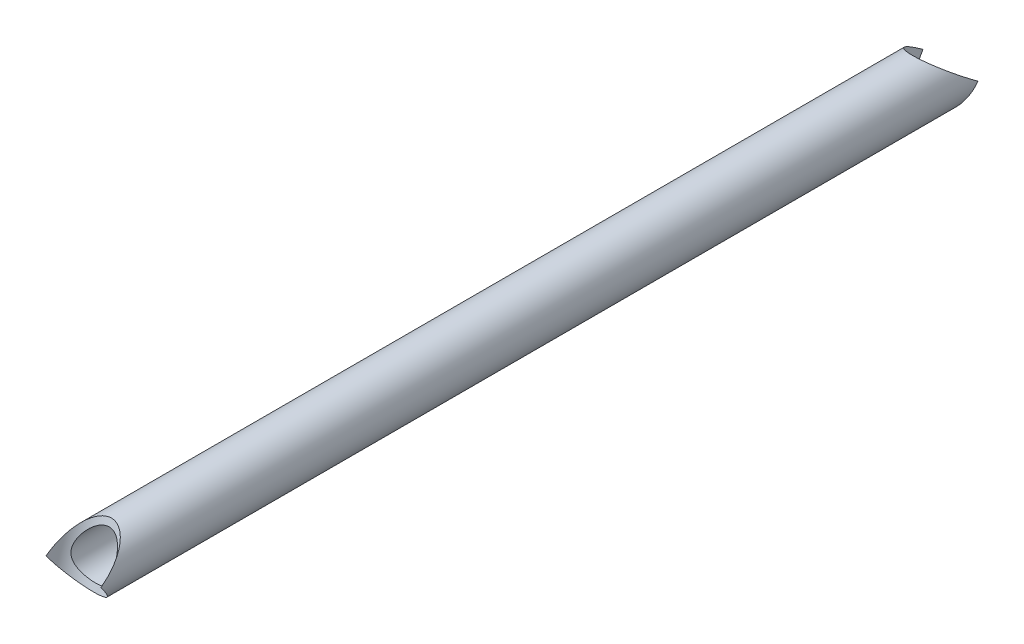
ISO-10303-21;
HEADER;
FILE_DESCRIPTION(('STEP AP214'),'2;1');
FILE_NAME('part.step','',(''),(''),'','','');
FILE_SCHEMA(('AUTOMOTIVE_DESIGN { 1 0 10303 214 1 1 1 1 }'));
ENDSEC;
DATA;
#1=APPLICATION_CONTEXT('core data for automotive mechanical design processes');
#2=APPLICATION_PROTOCOL_DEFINITION('international standard','automotive_design',2000,#1);
#3=PRODUCT_CONTEXT('',#1,'mechanical');
#4=PRODUCT('Part','Part','',(#3));
#5=PRODUCT_RELATED_PRODUCT_CATEGORY('part','',(#4));
#6=PRODUCT_DEFINITION_FORMATION('','',#4);
#7=PRODUCT_DEFINITION_CONTEXT('part definition',#1,'design');
#8=PRODUCT_DEFINITION('design','',#6,#7);
#9=PRODUCT_DEFINITION_SHAPE('','',#8);
#10=(LENGTH_UNIT() NAMED_UNIT(*) SI_UNIT(.MILLI.,.METRE.));
#11=(NAMED_UNIT(*) PLANE_ANGLE_UNIT() SI_UNIT($,.RADIAN.));
#12=(NAMED_UNIT(*) SI_UNIT($,.STERADIAN.) SOLID_ANGLE_UNIT());
#13=UNCERTAINTY_MEASURE_WITH_UNIT(LENGTH_MEASURE(1.E-05),#10,'distance_accuracy_value','');
#14=(GEOMETRIC_REPRESENTATION_CONTEXT(3) GLOBAL_UNCERTAINTY_ASSIGNED_CONTEXT((#13)) GLOBAL_UNIT_ASSIGNED_CONTEXT((#10,
#11,#12)) REPRESENTATION_CONTEXT('',''));
#15=CARTESIAN_POINT('',(0.,0.,0.));
#16=DIRECTION('',(0.,0.,1.));
#17=DIRECTION('',(1.,0.,0.));
#18=AXIS2_PLACEMENT_3D('',#15,#16,#17);
#19=CARTESIAN_POINT('',(1799.99999999996,750.,-202.656542434233));
#20=DIRECTION('',(0.,0.,1.));
#21=DIRECTION('',(0.,-1.,0.));
#22=AXIS2_PLACEMENT_3D('',#19,#20,#21);
#23=CYLINDRICAL_SURFACE('',#22,12.7000000000001);
#24=CARTESIAN_POINT('',(1799.99999999996,750.,202.656542434233));
#25=DIRECTION('',(0.,0.809899948955348,0.586568046080014));
#26=DIRECTION('',(0.,-0.586568046080014,0.809899948955347));
#27=AXIS2_PLACEMENT_3D('',#24,#25,#26);
#28=ELLIPSE('',#27,21.6513669383683,12.7000000000001);
#29=CARTESIAN_POINT('',(1812.69999999996,750.,202.656542434233));
#30=VERTEX_POINT('',#29);
#31=CARTESIAN_POINT('',(1787.29999999996,750.,202.656542434233));
#32=VERTEX_POINT('',#31);
#33=EDGE_CURVE('E73',#30,#32,#28,.T.);
#34=ORIENTED_EDGE('',*,*,#33,.F.);
#35=CARTESIAN_POINT('',(1799.99999999996,750.,202.656542434233));
#36=DIRECTION('',(0.,-0.586568046080014,0.809899948955347));
#37=DIRECTION('',(0.,0.809899948955348,0.586568046080014));
#38=AXIS2_PLACEMENT_3D('',#35,#36,#37);
#39=ELLIPSE('',#38,15.6809492535235,12.7000000000001);
#40=EDGE_CURVE('E80',#32,#30,#39,.T.);
#41=ORIENTED_EDGE('',*,*,#40,.F.);
#42=EDGE_LOOP('',(#34,#41));
#43=FACE_BOUND('',#42,.T.);
#44=CARTESIAN_POINT('',(1799.99999999996,750.,-202.656542434233));
#45=DIRECTION('',(0.,-0.809899948955348,0.586568046080014));
#46=DIRECTION('',(0.,0.586568046080014,0.809899948955348));
#47=AXIS2_PLACEMENT_3D('',#44,#45,#46);
#48=ELLIPSE('',#47,21.6513669383683,12.7000000000001);
#49=CARTESIAN_POINT('',(1787.29999999996,750.,-202.656542434233));
#50=VERTEX_POINT('',#49);
#51=CARTESIAN_POINT('',(1812.69999999996,750.,-202.656542434233));
#52=VERTEX_POINT('',#51);
#53=EDGE_CURVE('E56',#50,#52,#48,.F.);
#54=ORIENTED_EDGE('',*,*,#53,.F.);
#55=CARTESIAN_POINT('',(1799.99999999996,750.,-202.656542434233));
#56=DIRECTION('',(0.,0.586568046080014,0.809899948955348));
#57=DIRECTION('',(0.,-0.809899948955348,0.586568046080014));
#58=AXIS2_PLACEMENT_3D('',#55,#56,#57);
#59=ELLIPSE('',#58,15.6809492535235,12.7000000000001);
#60=EDGE_CURVE('E92',#52,#50,#59,.F.);
#61=ORIENTED_EDGE('',*,*,#60,.F.);
#62=EDGE_LOOP('',(#54,#61));
#63=FACE_BOUND('',#62,.T.);
#64=ADVANCED_FACE('F42',(#43,#63),#23,.T.);
#65=CARTESIAN_POINT('',(1799.99999999996,313.578191864488,345.911093985641));
#66=DIRECTION('',(0.,0.950122861158082,-0.31187585463575));
#67=DIRECTION('',(0.,0.31187585463575,0.950122861158083));
#68=AXIS2_PLACEMENT_3D('',#65,#66,#67);
#69=CYLINDRICAL_SURFACE('',#68,12.7000000000001);
#70=CARTESIAN_POINT('',(1799.99999999996,740.35,192.457442508405));
#71=CARTESIAN_POINT('',(1800.25549487288,740.350001323021,192.457443622493));
#72=CARTESIAN_POINT('',(1800.51102005776,740.360158682982,192.462237696364));
#73=CARTESIAN_POINT('',(1801.02020769019,740.400679650956,192.481299084192));
#74=CARTESIAN_POINT('',(1801.27386920683,740.431052743669,192.495570844827));
#75=CARTESIAN_POINT('',(1801.77777285061,740.511731274688,192.533262770259));
#76=CARTESIAN_POINT('',(1802.02800812342,740.562071931625,192.556699098409));
#77=CARTESIAN_POINT('',(1802.52277876452,740.682119935979,192.612127119238));
#78=CARTESIAN_POINT('',(1802.7673147654,740.751825122821,192.644117857454));
#79=CARTESIAN_POINT('',(1803.24818803531,740.909589137486,192.715725480426));
#80=CARTESIAN_POINT('',(1803.4845527567,740.997577725796,192.75531313677));
#81=CARTESIAN_POINT('',(1803.94864011668,741.191256009569,192.841225094051));
#82=CARTESIAN_POINT('',(1804.17636252112,741.296946184235,192.887549577358));
#83=CARTESIAN_POINT('',(1804.62191045395,741.525149617215,192.98579696155));
#84=CARTESIAN_POINT('',(1804.83973703841,741.647661074751,193.037719263042));
#85=CARTESIAN_POINT('',(1805.2644830828,741.908655160884,193.145880137793));
#86=CARTESIAN_POINT('',(1805.47140170318,742.047139016225,193.202119042475));
#87=CARTESIAN_POINT('',(1805.88486235884,742.347558462195,193.320745857496));
#88=CARTESIAN_POINT('',(1806.09071254282,742.510380261104,193.383301561329));
#89=CARTESIAN_POINT('',(1806.48827673088,742.852030154122,193.509683779826));
#90=CARTESIAN_POINT('',(1806.67998943992,743.03085971127,193.573510410232));
#91=CARTESIAN_POINT('',(1807.04847644642,743.403771719313,193.700246977002));
#92=CARTESIAN_POINT('',(1807.2252438939,743.59786108654,193.763156482198));
#93=CARTESIAN_POINT('',(1807.56285695886,744.000442530672,193.885464860626));
#94=CARTESIAN_POINT('',(1807.72370494432,744.208932457671,193.944864255448));
#95=CARTESIAN_POINT('',(1808.00586503641,744.607500702444,194.048805741095));
#96=CARTESIAN_POINT('',(1808.12949898293,744.79570400977,194.094243514559));
#97=CARTESIAN_POINT('',(1808.36389151701,745.181418667805,194.17827695509));
#98=CARTESIAN_POINT('',(1808.47465239622,745.378928352975,194.216873840611));
#99=CARTESIAN_POINT('',(1808.68241076884,745.782226491587,194.284801348342));
#100=CARTESIAN_POINT('',(1808.77942949396,745.988001529347,194.314146352706));
#101=CARTESIAN_POINT('',(1808.95908020595,746.407047869773,194.361086526165));
#102=CARTESIAN_POINT('',(1809.04171556416,746.620317401672,194.378684451422));
#103=CARTESIAN_POINT('',(1809.17802209854,747.013135936708,194.397666541575));
#104=CARTESIAN_POINT('',(1809.23422572469,747.191692734796,194.401433075631));
#105=CARTESIAN_POINT('',(1809.33612103124,747.551671328574,194.398195401329));
#106=CARTESIAN_POINT('',(1809.38181509837,747.733092463744,194.391193641261));
#107=CARTESIAN_POINT('',(1809.46240314622,748.097322571006,194.365483846722));
#108=CARTESIAN_POINT('',(1809.49730769211,748.280130004714,194.34678731846));
#109=CARTESIAN_POINT('',(1809.55630991435,748.645840700654,194.297187596506));
#110=CARTESIAN_POINT('',(1809.58040744014,748.828743964184,194.266284232755));
#111=CARTESIAN_POINT('',(1809.6179444127,749.193053281423,194.192307085178));
#112=CARTESIAN_POINT('',(1809.63139029556,749.374460173605,194.149240672035));
#113=CARTESIAN_POINT('',(1809.64803300465,749.734564400215,194.05145907232));
#114=CARTESIAN_POINT('',(1809.65122982617,749.913261733396,193.996743880391));
#115=CARTESIAN_POINT('',(1809.64792758712,750.267080111384,193.876542333696));
#116=CARTESIAN_POINT('',(1809.64141882916,750.442197401888,193.811045264331));
#117=CARTESIAN_POINT('',(1809.61933491058,750.787991764668,193.670504152221));
#118=CARTESIAN_POINT('',(1809.60375698339,750.95866746542,193.595457201717));
#119=CARTESIAN_POINT('',(1809.55438111377,751.37859789749,193.397842930488));
#120=CARTESIAN_POINT('',(1809.51537872376,751.624847416442,193.270165722024));
#121=CARTESIAN_POINT('',(1809.42057265609,752.106070085262,193.000597826516));
#122=CARTESIAN_POINT('',(1809.36476006855,752.341037178363,192.858699628624));
#123=CARTESIAN_POINT('',(1809.23770761416,752.800771524353,192.563956842099));
#124=CARTESIAN_POINT('',(1809.16641633948,753.025501694764,192.411076941304));
#125=CARTESIAN_POINT('',(1809.00965259433,753.464530517462,192.09793927942));
#126=CARTESIAN_POINT('',(1808.92418087742,753.678829723269,191.937681910697));
#127=CARTESIAN_POINT('',(1808.69565857415,754.197928400123,191.534527439305));
#128=CARTESIAN_POINT('',(1808.54461852046,754.497002626095,191.288757395988));
#129=CARTESIAN_POINT('',(1808.21405160023,755.07571776881,190.79330278772));
#130=CARTESIAN_POINT('',(1808.03450921087,755.355347976,190.543616156899));
#131=CARTESIAN_POINT('',(1807.64702945255,755.895400680145,190.046285396392));
#132=CARTESIAN_POINT('',(1807.43912541094,756.15584517683,189.798639225894));
#133=CARTESIAN_POINT('',(1806.99390572254,756.657336019245,189.310443348592));
#134=CARTESIAN_POINT('',(1806.75660765288,756.898393817006,189.069889506233));
#135=CARTESIAN_POINT('',(1806.33495427416,757.283069761803,188.679017031083));
#136=CARTESIAN_POINT('',(1806.15910851009,757.432509014754,188.525209054726));
#137=CARTESIAN_POINT('',(1805.79311483468,757.721182189649,188.225024587417));
#138=CARTESIAN_POINT('',(1805.60296445181,757.860414339776,188.078649388044));
#139=CARTESIAN_POINT('',(1805.20840938185,758.127212001948,187.795747066043));
#140=CARTESIAN_POINT('',(1805.00403281708,758.254799440094,187.659201541821));
#141=CARTESIAN_POINT('',(1804.58045996108,758.497140691738,187.398004368798));
#142=CARTESIAN_POINT('',(1804.36126260159,758.611893578547,187.273353578923));
#143=CARTESIAN_POINT('',(1803.96165535103,758.801392178497,187.066328805229));
#144=CARTESIAN_POINT('',(1803.78426766834,758.879195375366,186.980911776346));
#145=CARTESIAN_POINT('',(1803.42129680177,759.025268891258,186.819948007434));
#146=CARTESIAN_POINT('',(1803.23571576256,759.093541685686,186.744398704712));
#147=CARTESIAN_POINT('',(1802.85690652499,759.219567107317,186.604522513021));
#148=CARTESIAN_POINT('',(1802.66367930949,759.277321081338,186.540194187375));
#149=CARTESIAN_POINT('',(1802.2705280698,759.381285446411,186.424126762712));
#150=CARTESIAN_POINT('',(1802.07060725257,759.427501278216,186.372381730407));
#151=CARTESIAN_POINT('',(1801.66326033196,759.507868711331,186.282251378498));
#152=CARTESIAN_POINT('',(1801.45578029441,759.541899143086,186.244000293015));
#153=CARTESIAN_POINT('',(1801.03682497571,759.596463351321,186.182608722936));
#154=CARTESIAN_POINT('',(1800.82534971824,759.616997207794,186.159468148781));
#155=CARTESIAN_POINT('',(1800.40049764253,759.644033353097,186.128990471407));
#156=CARTESIAN_POINT('',(1800.18712210694,759.650544478395,186.121643415859));
#157=CARTESIAN_POINT('',(1799.76047164025,759.64938437089,186.122952075674));
#158=CARTESIAN_POINT('',(1799.54719670084,759.641714652837,186.131606081859));
#159=CARTESIAN_POINT('',(1799.15254040148,759.614458148224,186.162328524437));
#160=CARTESIAN_POINT('',(1798.97086756373,759.596686753307,186.182353065573));
#161=CARTESIAN_POINT('',(1798.61031585242,759.551141487398,186.233604984466));
#162=CARTESIAN_POINT('',(1798.43143800559,759.523364026837,186.264836382548));
#163=CARTESIAN_POINT('',(1798.07762271828,759.458294040171,186.337865874386));
#164=CARTESIAN_POINT('',(1797.90268541324,759.421001187512,186.379664330789));
#165=CARTESIAN_POINT('',(1797.55760743819,759.337491796046,186.473049506639));
#166=CARTESIAN_POINT('',(1797.38746783468,759.291273290782,186.524638383023));
#167=CARTESIAN_POINT('',(1796.99946091007,759.174546553594,186.654568373228));
#168=CARTESIAN_POINT('',(1796.78360370861,759.100986500458,186.736201591388));
#169=CARTESIAN_POINT('',(1796.36247723364,758.941014319533,186.912914513668));
#170=CARTESIAN_POINT('',(1796.15721091011,758.854598636695,187.007997936901));
#171=CARTESIAN_POINT('',(1795.55755505863,758.577939411907,187.310740153673));
#172=CARTESIAN_POINT('',(1795.17967382371,758.370397563077,187.535762858711));
#173=CARTESIAN_POINT('',(1794.57022330676,757.983177373973,187.949079935163));
#174=CARTESIAN_POINT('',(1794.32752412505,757.812251719059,188.129730155375));
#175=CARTESIAN_POINT('',(1793.86438838897,757.454020578336,188.503271716658));
#176=CARTESIAN_POINT('',(1793.64396214969,757.266707577428,188.696168662731));
#177=CARTESIAN_POINT('',(1793.22430267246,756.877108448541,189.090809819131));
#178=CARTESIAN_POINT('',(1793.02511402581,756.674792271883,189.29257143563));
#179=CARTESIAN_POINT('',(1792.64761055721,756.256533226051,189.701282076314));
#180=CARTESIAN_POINT('',(1792.46929255225,756.040592442542,189.908230303619));
#181=CARTESIAN_POINT('',(1792.12586067422,755.586136827798,190.332926803768));
#182=CARTESIAN_POINT('',(1791.9616082846,755.347056026864,190.550765395093));
#183=CARTESIAN_POINT('',(1791.65471745772,754.854180066541,190.985197268986));
#184=CARTESIAN_POINT('',(1791.51208465764,754.600381093244,191.201790212644));
#185=CARTESIAN_POINT('',(1791.24902881245,754.077797945792,191.629194043515));
#186=CARTESIAN_POINT('',(1791.12856353348,753.809043564991,191.840015260545));
#187=CARTESIAN_POINT('',(1790.91061743301,753.254877419365,192.251317490749));
#188=CARTESIAN_POINT('',(1790.81312276071,752.969475822676,192.451804677857));
#189=CARTESIAN_POINT('',(1790.6771616148,752.498200186587,192.75937148386));
#190=CARTESIAN_POINT('',(1790.63067064921,752.318095291124,192.871779890098));
#191=CARTESIAN_POINT('',(1790.54741881902,751.951059653571,193.088954481222));
#192=CARTESIAN_POINT('',(1790.51065952968,751.764127811982,193.193719426891));
#193=CARTESIAN_POINT('',(1790.44777271521,751.383680554363,193.393573852416));
#194=CARTESIAN_POINT('',(1790.4216323178,751.190173419305,193.488674941304));
#195=CARTESIAN_POINT('',(1790.38091806364,750.79676597927,193.667270563039));
#196=CARTESIAN_POINT('',(1790.36633805969,750.596869130917,193.750771244859));
#197=CARTESIAN_POINT('',(1790.34964488383,750.18842971268,193.905333319202));
#198=CARTESIAN_POINT('',(1790.34771583569,749.979803744319,193.976196452484));
#199=CARTESIAN_POINT('',(1790.35781555688,749.558156032711,194.102184646032));
#200=CARTESIAN_POINT('',(1790.36984327894,749.345134620461,194.157310886757));
#201=CARTESIAN_POINT('',(1790.40856621859,748.916918714584,194.250691423387));
#202=CARTESIAN_POINT('',(1790.43524860618,748.701726283196,194.288960424876));
#203=CARTESIAN_POINT('',(1790.50358832469,748.271383818422,194.348553961859));
#204=CARTESIAN_POINT('',(1790.54524469887,748.056233783204,194.369879579651));
#205=CARTESIAN_POINT('',(1790.63588394245,747.661104269435,194.394437457272));
#206=CARTESIAN_POINT('',(1790.68277416739,747.480774887015,194.399936803821));
#207=CARTESIAN_POINT('',(1790.78694036957,747.123067159137,194.400409801545));
#208=CARTESIAN_POINT('',(1790.84422022304,746.945689942152,194.395379516839));
#209=CARTESIAN_POINT('',(1790.96882938514,746.594833647064,194.376025860103));
#210=CARTESIAN_POINT('',(1791.03616917142,746.421358852778,194.361692746282));
#211=CARTESIAN_POINT('',(1791.18042332613,746.079280000255,194.325102471177));
#212=CARTESIAN_POINT('',(1791.25733997726,745.910677115112,194.302843418336));
#213=CARTESIAN_POINT('',(1791.45349474402,745.511420290724,194.241391936386));
#214=CARTESIAN_POINT('',(1791.57721416672,745.283449226378,194.198994951274));
#215=CARTESIAN_POINT('',(1791.84161472563,744.839569213609,194.104885896625));
#216=CARTESIAN_POINT('',(1791.9823018102,744.623664534355,194.053170557186));
#217=CARTESIAN_POINT('',(1792.27977036748,744.204602032014,193.943577939414));
#218=CARTESIAN_POINT('',(1792.43656711958,744.001456610333,193.885694809198));
#219=CARTESIAN_POINT('',(1792.76525293462,743.608875504925,193.766578538638));
#220=CARTESIAN_POINT('',(1792.93714056116,743.419438519505,193.705345717336));
#221=CARTESIAN_POINT('',(1793.29826092813,743.051856941739,193.580852366665));
#222=CARTESIAN_POINT('',(1793.48773855288,742.873958594179,193.51757506114));
#223=CARTESIAN_POINT('',(1793.88064626233,742.53384150912,193.392173068986));
#224=CARTESIAN_POINT('',(1794.08407664852,742.371623110617,193.3300484073));
#225=CARTESIAN_POINT('',(1794.50399080142,742.063744048421,193.208846212577));
#226=CARTESIAN_POINT('',(1794.72047529117,741.918084303191,193.149768848664));
#227=CARTESIAN_POINT('',(1795.1654456827,741.644294048444,193.036342385922));
#228=CARTESIAN_POINT('',(1795.39393154046,741.516163474658,192.981993269757));
#229=CARTESIAN_POINT('',(1795.87570590617,741.27131159708,192.876436030639));
#230=CARTESIAN_POINT('',(1796.12966047647,741.15573141817,192.825610328285));
#231=CARTESIAN_POINT('',(1796.64804191089,740.94654757622,192.732459102261));
#232=CARTESIAN_POINT('',(1796.91247065245,740.852947874092,192.69013511081));
#233=CARTESIAN_POINT('',(1797.44914912554,740.689027614362,192.61535969527));
#234=CARTESIAN_POINT('',(1797.72137977262,740.618654775917,192.582886112645));
#235=CARTESIAN_POINT('',(1798.2718415182,740.501839816053,192.528686956707));
#236=CARTESIAN_POINT('',(1798.55006873468,740.455382669913,192.506954635679));
#237=CARTESIAN_POINT('',(1799.0239031941,740.397505462288,192.479810169177));
#238=CARTESIAN_POINT('',(1799.21858824696,740.379702873918,192.471433839901));
#239=CARTESIAN_POINT('',(1799.60884294999,740.355949683136,192.460249605056));
#240=CARTESIAN_POINT('',(1799.80441259316,740.349998987196,192.457441655544));
#241=CARTESIAN_POINT('',(1799.99999999996,740.35,192.457442508405));
#242=B_SPLINE_CURVE_WITH_KNOTS('',3,(#70,#71,#72,#73,#74,#75,#76,#77,#78,#79,#80,#81,#82,#83,
#84,#85,#86,#87,#88,#89,#90,#91,#92,#93,#94,#95,#96,#97,#98,#99,#100,#101,#102,#103,#104,#105,
#106,#107,#108,#109,#110,#111,#112,#113,#114,#115,#116,#117,#118,#119,#120,#121,#122,#123,#124,
#125,#126,#127,#128,#129,#130,#131,#132,#133,#134,#135,#136,#137,#138,#139,#140,#141,#142,#143,
#144,#145,#146,#147,#148,#149,#150,#151,#152,#153,#154,#155,#156,#157,#158,#159,#160,#161,#162,
#163,#164,#165,#166,#167,#168,#169,#170,#171,#172,#173,#174,#175,#176,#177,#178,#179,#180,#181,
#182,#183,#184,#185,#186,#187,#188,#189,#190,#191,#192,#193,#194,#195,#196,#197,#198,#199,#200,
#201,#202,#203,#204,#205,#206,#207,#208,#209,#210,#211,#212,#213,#214,#215,#216,#217,#218,#219,
#220,#221,#222,#223,#224,#225,#226,#227,#228,#229,#230,#231,#232,#233,#234,#235,#236,#237,#238,
#239,#240,#241),.UNSPECIFIED.,.T.,.F.,(4,2,2,2,2,2,2,2,2,2,2,2,2,2,2,2,2,2,2,2,2,2,2,2,2,2,2,2,
2,2,2,2,2,2,2,2,2,2,2,2,2,2,2,2,2,2,2,2,2,2,2,2,2,2,2,2,2,2,2,2,2,2,2,2,2,2,2,2,2,2,2,2,2,2,2,2,
2,2,2,2,2,2,2,2,2,4),(0.,0.766291926195464,1.53294363049779,2.30095360517248,3.0688779244002,
3.83390490849069,4.59895260612126,5.36391846636314,6.12894311822342,6.93751371653178,
7.74615829026181,8.55517150941467,9.36406420838398,10.0526235118687,10.7410600502143,
11.4284210685424,12.1156207579064,12.6767400225528,13.2377317293871,13.7981723558383,
14.3586207902745,14.9187303247367,15.4788401167754,16.0395099214707,16.6003508498326,
17.4393160703436,18.2787267509923,19.1209691319105,19.9631667703063,21.2080852878345,
22.4536841488168,23.6978317349493,24.9412389010381,25.7726609367374,26.6042269561632,
27.4341934239309,28.2642197788698,28.898775998303,29.5331670916535,30.1674769010515,
30.8014870375264,31.4416371939636,32.0817835562693,32.7215264101874,33.3612009328634,
33.9114722405448,34.4619411490766,35.012428951454,35.5630381734053,36.2885801904595,
37.0143232205675,38.467004435052,39.5083137067678,40.550103042663,41.5940383851388,
42.6378143071284,43.7251452635676,44.8127592492205,45.8982791448184,46.9831428093101,
47.6347703364725,48.2865032769063,48.9374438085458,49.5880379718326,50.2480803501741,
50.9080732042538,51.5674891610769,52.2268629928234,52.7854657775879,53.3442774003005,
53.9036751487813,54.4632064893344,55.2505322149401,56.0381347608199,56.8264913373154,
57.6147729564718,58.4164343230603,59.2181130173692,60.0198361568403,60.8215563567211,
61.6712389295705,62.5210744991078,63.3689839355375,64.2163600318931,64.8029793708447,
65.3895940805179),.UNSPECIFIED.);
#243=CARTESIAN_POINT('',(1799.99999999996,740.35,192.457442508405));
#244=VERTEX_POINT('',#243);
#245=EDGE_CURVE('E87',#244,#244,#242,.T.);
#246=ORIENTED_EDGE('',*,*,#245,.F.);
#247=EDGE_LOOP('',(#246));
#248=FACE_BOUND('',#247,.T.);
#249=ORIENTED_EDGE('',*,*,#33,.T.);
#250=ORIENTED_EDGE('',*,*,#40,.T.);
#251=EDGE_LOOP('',(#249,#250));
#252=FACE_BOUND('',#251,.T.);
#253=ADVANCED_FACE('F81',(#248,#252),#69,.F.);
#254=CARTESIAN_POINT('',(1799.99999999996,1128.44535180018,-78.4326421885894));
#255=DIRECTION('',(0.,-0.950122861158083,-0.311875854635749));
#256=DIRECTION('',(0.,0.311875854635749,-0.950122861158082));
#257=AXIS2_PLACEMENT_3D('',#254,#255,#256);
#258=CYLINDRICAL_SURFACE('',#257,12.7000000000001);
#259=CARTESIAN_POINT('',(1799.99999999996,740.35,-192.457442508405));
#260=CARTESIAN_POINT('',(1799.74450512705,740.350001323021,-192.457443622493));
#261=CARTESIAN_POINT('',(1799.48897994216,740.360158682982,-192.462237696364));
#262=CARTESIAN_POINT('',(1798.97979230974,740.400679650956,-192.481299084192));
#263=CARTESIAN_POINT('',(1798.7261307931,740.431052743669,-192.495570844827));
#264=CARTESIAN_POINT('',(1798.22222714932,740.511731274689,-192.533262770259));
#265=CARTESIAN_POINT('',(1797.9719918765,740.562071931625,-192.556699098409));
#266=CARTESIAN_POINT('',(1797.4772212354,740.68211993598,-192.612127119238));
#267=CARTESIAN_POINT('',(1797.23268523452,740.751825122822,-192.644117857454));
#268=CARTESIAN_POINT('',(1796.75181196462,740.909589137486,-192.715725480426));
#269=CARTESIAN_POINT('',(1796.51544724323,740.997577725797,-192.75531313677));
#270=CARTESIAN_POINT('',(1796.05135988324,741.19125600957,-192.841225094051));
#271=CARTESIAN_POINT('',(1795.8236374788,741.296946184235,-192.887549577357));
#272=CARTESIAN_POINT('',(1795.37808954597,741.525149617216,-192.98579696155));
#273=CARTESIAN_POINT('',(1795.16026296152,741.647661074751,-193.037719263042));
#274=CARTESIAN_POINT('',(1794.73551691712,741.908655160884,-193.145880137793));
#275=CARTESIAN_POINT('',(1794.52859829675,742.047139016226,-193.202119042475));
#276=CARTESIAN_POINT('',(1794.11513764109,742.347558462195,-193.320745857496));
#277=CARTESIAN_POINT('',(1793.90928745711,742.510380261104,-193.383301561329));
#278=CARTESIAN_POINT('',(1793.51172326905,742.852030154122,-193.509683779826));
#279=CARTESIAN_POINT('',(1793.32001056,743.030859711271,-193.573510410232));
#280=CARTESIAN_POINT('',(1792.9515235535,743.403771719313,-193.700246977002));
#281=CARTESIAN_POINT('',(1792.77475610602,743.59786108654,-193.763156482198));
#282=CARTESIAN_POINT('',(1792.43714304106,744.000442530672,-193.885464860626));
#283=CARTESIAN_POINT('',(1792.2762950556,744.208932457671,-193.944864255447));
#284=CARTESIAN_POINT('',(1791.99413496352,744.607500702445,-194.048805741095));
#285=CARTESIAN_POINT('',(1791.870501017,744.79570400977,-194.094243514559));
#286=CARTESIAN_POINT('',(1791.63610848292,745.181418667805,-194.17827695509));
#287=CARTESIAN_POINT('',(1791.5253476037,745.378928352975,-194.216873840611));
#288=CARTESIAN_POINT('',(1791.31758923109,745.782226491587,-194.284801348342));
#289=CARTESIAN_POINT('',(1791.22057050596,745.988001529347,-194.314146352705));
#290=CARTESIAN_POINT('',(1791.04091979397,746.407047869773,-194.361086526165));
#291=CARTESIAN_POINT('',(1790.95828443577,746.620317401673,-194.378684451422));
#292=CARTESIAN_POINT('',(1790.82197790139,747.013135936708,-194.397666541575));
#293=CARTESIAN_POINT('',(1790.76577427523,747.191692734796,-194.401433075631));
#294=CARTESIAN_POINT('',(1790.66387896869,747.551671328574,-194.398195401328));
#295=CARTESIAN_POINT('',(1790.61818490156,747.733092463744,-194.391193641261));
#296=CARTESIAN_POINT('',(1790.53759685371,748.097322571006,-194.365483846722));
#297=CARTESIAN_POINT('',(1790.50269230782,748.280130004714,-194.34678731846));
#298=CARTESIAN_POINT('',(1790.44369008557,748.645840700654,-194.297187596506));
#299=CARTESIAN_POINT('',(1790.41959255979,748.828743964184,-194.266284232755));
#300=CARTESIAN_POINT('',(1790.38205558722,749.193053281423,-194.192307085177));
#301=CARTESIAN_POINT('',(1790.36860970437,749.374460173606,-194.149240672034));
#302=CARTESIAN_POINT('',(1790.35196699528,749.734564400216,-194.05145907232));
#303=CARTESIAN_POINT('',(1790.34877017376,749.913261733396,-193.996743880391));
#304=CARTESIAN_POINT('',(1790.35207241281,750.267080111384,-193.876542333696));
#305=CARTESIAN_POINT('',(1790.35858117077,750.442197401888,-193.811045264331));
#306=CARTESIAN_POINT('',(1790.38066508935,750.787991764669,-193.67050415222));
#307=CARTESIAN_POINT('',(1790.39624301654,750.95866746542,-193.595457201717));
#308=CARTESIAN_POINT('',(1790.44561888616,751.37859789749,-193.397842930488));
#309=CARTESIAN_POINT('',(1790.48462127617,751.624847416442,-193.270165722024));
#310=CARTESIAN_POINT('',(1790.57942734383,752.106070085262,-193.000597826515));
#311=CARTESIAN_POINT('',(1790.63523993138,752.341037178363,-192.858699628624));
#312=CARTESIAN_POINT('',(1790.76229238577,752.800771524354,-192.563956842099));
#313=CARTESIAN_POINT('',(1790.83358366045,753.025501694764,-192.411076941304));
#314=CARTESIAN_POINT('',(1790.99034740559,753.464530517462,-192.09793927942));
#315=CARTESIAN_POINT('',(1791.07581912251,753.678829723269,-191.937681910697));
#316=CARTESIAN_POINT('',(1791.30434142577,754.197928400123,-191.534527439305));
#317=CARTESIAN_POINT('',(1791.45538147946,754.497002626095,-191.288757395988));
#318=CARTESIAN_POINT('',(1791.78594839969,755.07571776881,-190.79330278772));
#319=CARTESIAN_POINT('',(1791.96549078906,755.355347975999,-190.5436161569));
#320=CARTESIAN_POINT('',(1792.35297054738,755.895400680145,-190.046285396392));
#321=CARTESIAN_POINT('',(1792.56087458898,756.15584517683,-189.798639225894));
#322=CARTESIAN_POINT('',(1793.00609427739,756.657336019244,-189.310443348592));
#323=CARTESIAN_POINT('',(1793.24339234705,756.898393817006,-189.069889506233));
#324=CARTESIAN_POINT('',(1793.66504572577,757.283069761803,-188.679017031083));
#325=CARTESIAN_POINT('',(1793.84089148984,757.432509014754,-188.525209054726));
#326=CARTESIAN_POINT('',(1794.20688516525,757.721182189649,-188.225024587417));
#327=CARTESIAN_POINT('',(1794.39703554812,757.860414339776,-188.078649388044));
#328=CARTESIAN_POINT('',(1794.79159061807,758.127212001948,-187.795747066043));
#329=CARTESIAN_POINT('',(1794.99596718285,758.254799440094,-187.659201541821));
#330=CARTESIAN_POINT('',(1795.41954003884,758.497140691738,-187.398004368798));
#331=CARTESIAN_POINT('',(1795.63873739833,758.611893578547,-187.273353578923));
#332=CARTESIAN_POINT('',(1796.03834464889,758.801392178497,-187.066328805229));
#333=CARTESIAN_POINT('',(1796.21573233159,758.879195375366,-186.980911776346));
#334=CARTESIAN_POINT('',(1796.57870319816,759.025268891258,-186.819948007434));
#335=CARTESIAN_POINT('',(1796.76428423736,759.093541685686,-186.744398704712));
#336=CARTESIAN_POINT('',(1797.14309347493,759.219567107317,-186.604522513021));
#337=CARTESIAN_POINT('',(1797.33632069043,759.277321081338,-186.540194187375));
#338=CARTESIAN_POINT('',(1797.72947193012,759.381285446411,-186.424126762711));
#339=CARTESIAN_POINT('',(1797.92939274735,759.427501278216,-186.372381730406));
#340=CARTESIAN_POINT('',(1798.33673966796,759.507868711331,-186.282251378498));
#341=CARTESIAN_POINT('',(1798.54421970551,759.541899143086,-186.244000293015));
#342=CARTESIAN_POINT('',(1798.96317502421,759.596463351321,-186.182608722935));
#343=CARTESIAN_POINT('',(1799.17465028168,759.616997207794,-186.15946814878));
#344=CARTESIAN_POINT('',(1799.59950235739,759.644033353097,-186.128990471407));
#345=CARTESIAN_POINT('',(1799.81287789299,759.650544478395,-186.121643415858));
#346=CARTESIAN_POINT('',(1800.23952835968,759.64938437089,-186.122952075674));
#347=CARTESIAN_POINT('',(1800.45280329909,759.641714652837,-186.131606081858));
#348=CARTESIAN_POINT('',(1800.84745959844,759.614458148224,-186.162328524437));
#349=CARTESIAN_POINT('',(1801.0291324362,759.596686753307,-186.182353065572));
#350=CARTESIAN_POINT('',(1801.38968414751,759.551141487398,-186.233604984466));
#351=CARTESIAN_POINT('',(1801.56856199433,759.523364026837,-186.264836382547));
#352=CARTESIAN_POINT('',(1801.92237728165,759.458294040171,-186.337865874386));
#353=CARTESIAN_POINT('',(1802.09731458669,759.421001187512,-186.379664330789));
#354=CARTESIAN_POINT('',(1802.44239256173,759.337491796046,-186.473049506639));
#355=CARTESIAN_POINT('',(1802.61253216525,759.291273290782,-186.524638383023));
#356=CARTESIAN_POINT('',(1803.00053908985,759.174546553594,-186.654568373228));
#357=CARTESIAN_POINT('',(1803.21639629132,759.100986500458,-186.736201591388));
#358=CARTESIAN_POINT('',(1803.63752276629,758.941014319533,-186.912914513668));
#359=CARTESIAN_POINT('',(1803.84278908982,758.854598636695,-187.007997936901));
#360=CARTESIAN_POINT('',(1804.4424449413,758.577939411906,-187.310740153673));
#361=CARTESIAN_POINT('',(1804.82032617622,758.370397563077,-187.535762858711));
#362=CARTESIAN_POINT('',(1805.42977669317,757.983177373973,-187.949079935163));
#363=CARTESIAN_POINT('',(1805.67247587488,757.812251719059,-188.129730155376));
#364=CARTESIAN_POINT('',(1806.13561161096,757.454020578335,-188.503271716658));
#365=CARTESIAN_POINT('',(1806.35603785024,757.266707577428,-188.696168662732));
#366=CARTESIAN_POINT('',(1806.77569732747,756.877108448541,-189.090809819131));
#367=CARTESIAN_POINT('',(1806.97488597412,756.674792271883,-189.29257143563));
#368=CARTESIAN_POINT('',(1807.35238944272,756.256533226051,-189.701282076314));
#369=CARTESIAN_POINT('',(1807.53070744768,756.040592442542,-189.90823030362));
#370=CARTESIAN_POINT('',(1807.87413932571,755.586136827798,-190.332926803768));
#371=CARTESIAN_POINT('',(1808.03839171533,755.347056026864,-190.550765395093));
#372=CARTESIAN_POINT('',(1808.34528254221,754.854180066541,-190.985197268986));
#373=CARTESIAN_POINT('',(1808.48791534229,754.600381093243,-191.201790212644));
#374=CARTESIAN_POINT('',(1808.75097118748,754.077797945792,-191.629194043515));
#375=CARTESIAN_POINT('',(1808.87143646645,753.80904356499,-191.840015260546));
#376=CARTESIAN_POINT('',(1809.08938256692,753.254877419365,-192.25131749075));
#377=CARTESIAN_POINT('',(1809.18687723922,752.969475822676,-192.451804677857));
#378=CARTESIAN_POINT('',(1809.32283838513,752.498200186587,-192.75937148386));
#379=CARTESIAN_POINT('',(1809.36932935072,752.318095291124,-192.871779890098));
#380=CARTESIAN_POINT('',(1809.4525811809,751.95105965357,-193.088954481222));
#381=CARTESIAN_POINT('',(1809.48934047024,751.764127811981,-193.193719426891));
#382=CARTESIAN_POINT('',(1809.55222728472,751.383680554362,-193.393573852416));
#383=CARTESIAN_POINT('',(1809.57836768213,751.190173419304,-193.488674941304));
#384=CARTESIAN_POINT('',(1809.61908193628,750.79676597927,-193.667270563039));
#385=CARTESIAN_POINT('',(1809.63366194023,750.596869130917,-193.750771244859));
#386=CARTESIAN_POINT('',(1809.6503551161,750.188429712679,-193.905333319202));
#387=CARTESIAN_POINT('',(1809.65228416424,749.979803744319,-193.976196452484));
#388=CARTESIAN_POINT('',(1809.64218444305,749.55815603271,-194.102184646032));
#389=CARTESIAN_POINT('',(1809.63015672099,749.34513462046,-194.157310886757));
#390=CARTESIAN_POINT('',(1809.59143378134,748.916918714583,-194.250691423387));
#391=CARTESIAN_POINT('',(1809.56475139375,748.701726283196,-194.288960424876));
#392=CARTESIAN_POINT('',(1809.49641167523,748.271383818421,-194.348553961859));
#393=CARTESIAN_POINT('',(1809.45475530106,748.056233783204,-194.369879579651));
#394=CARTESIAN_POINT('',(1809.36411605748,747.661104269435,-194.394437457272));
#395=CARTESIAN_POINT('',(1809.31722583253,747.480774887015,-194.399936803821));
#396=CARTESIAN_POINT('',(1809.21305963036,747.123067159137,-194.400409801545));
#397=CARTESIAN_POINT('',(1809.15577977689,746.945689942152,-194.395379516839));
#398=CARTESIAN_POINT('',(1809.03117061479,746.594833647064,-194.376025860103));
#399=CARTESIAN_POINT('',(1808.9638308285,746.421358852778,-194.361692746282));
#400=CARTESIAN_POINT('',(1808.8195766738,746.079280000255,-194.325102471177));
#401=CARTESIAN_POINT('',(1808.74266002267,745.910677115112,-194.302843418336));
#402=CARTESIAN_POINT('',(1808.54650525591,745.511420290724,-194.241391936386));
#403=CARTESIAN_POINT('',(1808.42278583321,745.283449226378,-194.198994951274));
#404=CARTESIAN_POINT('',(1808.1583852743,744.839569213609,-194.104885896625));
#405=CARTESIAN_POINT('',(1808.01769818972,744.623664534355,-194.053170557185));
#406=CARTESIAN_POINT('',(1807.72022963245,744.204602032013,-193.943577939413));
#407=CARTESIAN_POINT('',(1807.56343288034,744.001456610333,-193.885694809198));
#408=CARTESIAN_POINT('',(1807.2347470653,743.608875504925,-193.766578538637));
#409=CARTESIAN_POINT('',(1807.06285943877,743.419438519505,-193.705345717336));
#410=CARTESIAN_POINT('',(1806.7017390718,743.051856941739,-193.580852366665));
#411=CARTESIAN_POINT('',(1806.51226144705,742.873958594178,-193.51757506114));
#412=CARTESIAN_POINT('',(1806.1193537376,742.53384150912,-193.392173068986));
#413=CARTESIAN_POINT('',(1805.9159233514,742.371623110617,-193.330048407299));
#414=CARTESIAN_POINT('',(1805.49600919851,742.063744048421,-193.208846212577));
#415=CARTESIAN_POINT('',(1805.27952470875,741.918084303191,-193.149768848664));
#416=CARTESIAN_POINT('',(1804.83455431723,741.644294048444,-193.036342385922));
#417=CARTESIAN_POINT('',(1804.60606845946,741.516163474658,-192.981993269757));
#418=CARTESIAN_POINT('',(1804.12429409376,741.27131159708,-192.876436030639));
#419=CARTESIAN_POINT('',(1803.87033952346,741.15573141817,-192.825610328285));
#420=CARTESIAN_POINT('',(1803.35195808903,740.94654757622,-192.732459102261));
#421=CARTESIAN_POINT('',(1803.08752934747,740.852947874093,-192.69013511081));
#422=CARTESIAN_POINT('',(1802.55085087439,740.689027614362,-192.61535969527));
#423=CARTESIAN_POINT('',(1802.27862022731,740.618654775917,-192.582886112645));
#424=CARTESIAN_POINT('',(1801.72815848173,740.501839816053,-192.528686956706));
#425=CARTESIAN_POINT('',(1801.44993126525,740.455382669913,-192.506954635679));
#426=CARTESIAN_POINT('',(1800.97609680582,740.397505462288,-192.479810169177));
#427=CARTESIAN_POINT('',(1800.78141175296,740.379702873918,-192.471433839901));
#428=CARTESIAN_POINT('',(1800.39115704994,740.355949683137,-192.460249605056));
#429=CARTESIAN_POINT('',(1800.19558740676,740.349998987196,-192.457441655544));
#430=CARTESIAN_POINT('',(1799.99999999996,740.35,-192.457442508405));
#431=B_SPLINE_CURVE_WITH_KNOTS('',3,(#259,#260,#261,#262,#263,#264,#265,#266,#267,#268,#269,
#270,#271,#272,#273,#274,#275,#276,#277,#278,#279,#280,#281,#282,#283,#284,#285,#286,#287,#288,
#289,#290,#291,#292,#293,#294,#295,#296,#297,#298,#299,#300,#301,#302,#303,#304,#305,#306,#307,
#308,#309,#310,#311,#312,#313,#314,#315,#316,#317,#318,#319,#320,#321,#322,#323,#324,#325,#326,
#327,#328,#329,#330,#331,#332,#333,#334,#335,#336,#337,#338,#339,#340,#341,#342,#343,#344,#345,
#346,#347,#348,#349,#350,#351,#352,#353,#354,#355,#356,#357,#358,#359,#360,#361,#362,#363,#364,
#365,#366,#367,#368,#369,#370,#371,#372,#373,#374,#375,#376,#377,#378,#379,#380,#381,#382,#383,
#384,#385,#386,#387,#388,#389,#390,#391,#392,#393,#394,#395,#396,#397,#398,#399,#400,#401,#402,
#403,#404,#405,#406,#407,#408,#409,#410,#411,#412,#413,#414,#415,#416,#417,#418,#419,#420,#421,
#422,#423,#424,#425,#426,#427,#428,#429,#430),.UNSPECIFIED.,.T.,.F.,(4,2,2,2,2,2,2,2,2,2,2,2,2,
2,2,2,2,2,2,2,2,2,2,2,2,2,2,2,2,2,2,2,2,2,2,2,2,2,2,2,2,2,2,2,2,2,2,2,2,2,2,2,2,2,2,2,2,2,2,2,2,
2,2,2,2,2,2,2,2,2,2,2,2,2,2,2,2,2,2,2,2,2,2,2,2,4),(0.,0.766291926195464,1.53294363049779,
2.3009536051725,3.0688779244002,3.83390490849094,4.5989526061215,5.36391846636364,
6.12894311822341,6.9375137165321,7.74615829026156,8.55517150941433,9.36406420838388,
10.0526235118686,10.7410600502142,11.4284210685423,12.1156207579063,12.6767400225527,
13.2377317293869,13.7981723558382,14.3586207902745,14.9187303247367,15.4788401167755,
16.0395099214708,16.6003508498326,17.4393160703437,18.2787267509923,19.1209691319103,
19.9631667703061,21.2080852878343,22.4536841488162,23.6978317349485,24.9412389010376,
25.7726609367371,26.6042269561628,27.4341934239311,28.2642197788695,28.8987759983028,
29.5331670916532,30.1674769010509,30.8014870375263,31.4416371939635,32.0817835562695,
32.7215264101874,33.3612009328636,33.9114722405449,34.461941149077,35.0124289514544,
35.5630381734058,36.2885801904599,37.0143232205678,38.4670044350525,39.5083137067682,
40.5501030426636,41.5940383851395,42.6378143071292,43.7251452635683,44.8127592492214,
45.8982791448192,46.9831428093112,47.6347703364734,48.2865032769071,48.9374438085466,
49.5880379718333,50.2480803501749,50.9080732042546,51.5674891610777,52.226862992824,
52.7854657775883,53.3442774003008,53.9036751487816,54.4632064893347,55.2505322149407,
56.0381347608206,56.826491337316,57.6147729564724,58.4164343230606,59.2181130173697,
60.0198361568405,60.8215563567216,61.671238929571,62.521074499108,63.3689839355382,
64.2163600318937,64.8029793708451,65.3895940805179),.UNSPECIFIED.);
#432=CARTESIAN_POINT('',(1799.99999999996,740.35,-192.457442508405));
#433=VERTEX_POINT('',#432);
#434=EDGE_CURVE('E11',#433,#433,#431,.T.);
#435=ORIENTED_EDGE('',*,*,#434,.F.);
#436=EDGE_LOOP('',(#435));
#437=FACE_BOUND('',#436,.T.);
#438=ORIENTED_EDGE('',*,*,#53,.T.);
#439=ORIENTED_EDGE('',*,*,#60,.T.);
#440=EDGE_LOOP('',(#438,#439));
#441=FACE_BOUND('',#440,.T.);
#442=ADVANCED_FACE('F101',(#437,#441),#258,.F.);
#443=CARTESIAN_POINT('',(1799.99999999996,750.,-202.656542434233));
#444=DIRECTION('',(0.,0.,1.));
#445=DIRECTION('',(0.,-1.,0.));
#446=AXIS2_PLACEMENT_3D('',#443,#444,#445);
#447=CYLINDRICAL_SURFACE('',#446,9.65000000000003);
#448=ORIENTED_EDGE('',*,*,#245,.T.);
#449=EDGE_LOOP('',(#448));
#450=FACE_BOUND('',#449,.T.);
#451=ORIENTED_EDGE('',*,*,#434,.T.);
#452=EDGE_LOOP('',(#451));
#453=FACE_BOUND('',#452,.T.);
#454=ADVANCED_FACE('F44',(#450,#453),#447,.F.);
#455=CLOSED_SHELL('',(#64,#253,#442,#454));
#456=MANIFOLD_SOLID_BREP('B2',#455);
#457=ADVANCED_BREP_SHAPE_REPRESENTATION('',(#18,#456),#14);
#458=SHAPE_DEFINITION_REPRESENTATION(#9,#457);
ENDSEC;
END-ISO-10303-21;
